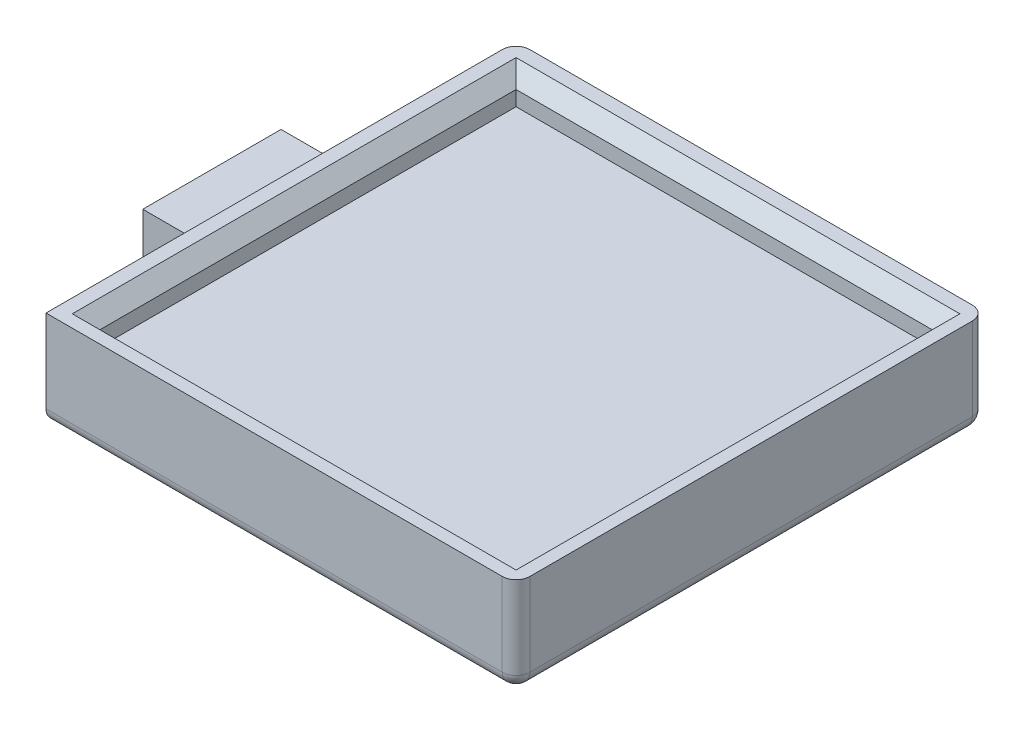
ISO-10303-21;
HEADER;
FILE_DESCRIPTION(('STEP AP214'),'2;1');
FILE_NAME('part.step','',(''),(''),'','','');
FILE_SCHEMA(('AUTOMOTIVE_DESIGN { 1 0 10303 214 1 1 1 1 }'));
ENDSEC;
DATA;
#1=APPLICATION_CONTEXT('core data for automotive mechanical design processes');
#2=APPLICATION_PROTOCOL_DEFINITION('international standard','automotive_design',2000,#1);
#3=PRODUCT_CONTEXT('',#1,'mechanical');
#4=PRODUCT('Part','Part','',(#3));
#5=PRODUCT_RELATED_PRODUCT_CATEGORY('part','',(#4));
#6=PRODUCT_DEFINITION_FORMATION('','',#4);
#7=PRODUCT_DEFINITION_CONTEXT('part definition',#1,'design');
#8=PRODUCT_DEFINITION('design','',#6,#7);
#9=PRODUCT_DEFINITION_SHAPE('','',#8);
#10=(LENGTH_UNIT() NAMED_UNIT(*) SI_UNIT(.MILLI.,.METRE.));
#11=(NAMED_UNIT(*) PLANE_ANGLE_UNIT() SI_UNIT($,.RADIAN.));
#12=(NAMED_UNIT(*) SI_UNIT($,.STERADIAN.) SOLID_ANGLE_UNIT());
#13=UNCERTAINTY_MEASURE_WITH_UNIT(LENGTH_MEASURE(1.E-05),#10,'distance_accuracy_value','');
#14=(GEOMETRIC_REPRESENTATION_CONTEXT(3) GLOBAL_UNCERTAINTY_ASSIGNED_CONTEXT((#13)) GLOBAL_UNIT_ASSIGNED_CONTEXT((#10,
#11,#12)) REPRESENTATION_CONTEXT('',''));
#15=CARTESIAN_POINT('',(0.,0.,0.));
#16=DIRECTION('',(0.,0.,1.));
#17=DIRECTION('',(1.,0.,0.));
#18=AXIS2_PLACEMENT_3D('',#15,#16,#17);
#19=CARTESIAN_POINT('',(0.,5.,0.));
#20=DIRECTION('',(0.,-1.,0.));
#21=DIRECTION('',(0.,0.,-1.));
#22=AXIS2_PLACEMENT_3D('',#19,#20,#21);
#23=PLANE('',#22);
#24=DIRECTION('',(0.,0.,1.));
#25=VECTOR('',#24,1.);
#26=CARTESIAN_POINT('',(5.,5.,0.));
#27=LINE('',#26,#25);
#28=CARTESIAN_POINT('',(5.,5.,-10.));
#29=VERTEX_POINT('',#28);
#30=CARTESIAN_POINT('',(5.,5.,0.));
#31=VERTEX_POINT('',#30);
#32=EDGE_CURVE('E248',#29,#31,#27,.T.);
#33=ORIENTED_EDGE('',*,*,#32,.F.);
#34=DIRECTION('',(1.,0.,0.));
#35=VECTOR('',#34,1.);
#36=CARTESIAN_POINT('',(0.,5.,-10.));
#37=LINE('',#36,#35);
#38=CARTESIAN_POINT('',(0.,5.,-10.));
#39=VERTEX_POINT('',#38);
#40=EDGE_CURVE('E259',#39,#29,#37,.T.);
#41=ORIENTED_EDGE('',*,*,#40,.F.);
#42=DIRECTION('',(0.,0.,-1.));
#43=VECTOR('',#42,1.);
#44=CARTESIAN_POINT('',(0.,5.,0.));
#45=LINE('',#44,#43);
#46=CARTESIAN_POINT('',(0.,5.,0.));
#47=VERTEX_POINT('',#46);
#48=EDGE_CURVE('E255',#47,#39,#45,.T.);
#49=ORIENTED_EDGE('',*,*,#48,.F.);
#50=DIRECTION('',(-1.,0.,0.));
#51=VECTOR('',#50,1.);
#52=CARTESIAN_POINT('',(5.,5.,0.));
#53=LINE('',#52,#51);
#54=EDGE_CURVE('E252',#31,#47,#53,.T.);
#55=ORIENTED_EDGE('',*,*,#54,.F.);
#56=EDGE_LOOP('',(#33,#41,#49,#55));
#57=FACE_BOUND('',#56,.T.);
#58=ADVANCED_FACE('F69',(#57),#23,.F.);
#59=CARTESIAN_POINT('',(5.,5.,0.));
#60=DIRECTION('',(0.,0.,1.));
#61=DIRECTION('',(1.,0.,0.));
#62=AXIS2_PLACEMENT_3D('',#59,#60,#61);
#63=PLANE('',#62);
#64=DIRECTION('',(-1.,0.,0.));
#65=VECTOR('',#64,1.);
#66=CARTESIAN_POINT('',(5.,0.,0.));
#67=LINE('',#66,#65);
#68=CARTESIAN_POINT('',(5.,0.,0.));
#69=VERTEX_POINT('',#68);
#70=CARTESIAN_POINT('',(0.,0.,0.));
#71=VERTEX_POINT('',#70);
#72=EDGE_CURVE('E247',#69,#71,#67,.T.);
#73=ORIENTED_EDGE('',*,*,#72,.F.);
#74=DIRECTION('',(0.,-1.,0.));
#75=VECTOR('',#74,1.);
#76=CARTESIAN_POINT('',(5.,5.,0.));
#77=LINE('',#76,#75);
#78=EDGE_CURVE('E251',#31,#69,#77,.T.);
#79=ORIENTED_EDGE('',*,*,#78,.F.);
#80=ORIENTED_EDGE('',*,*,#54,.T.);
#81=DIRECTION('',(0.,-1.,0.));
#82=VECTOR('',#81,1.);
#83=CARTESIAN_POINT('',(0.,5.,0.));
#84=LINE('',#83,#82);
#85=EDGE_CURVE('E262',#47,#71,#84,.T.);
#86=ORIENTED_EDGE('',*,*,#85,.T.);
#87=EDGE_LOOP('',(#73,#79,#80,#86));
#88=FACE_BOUND('',#87,.T.);
#89=ADVANCED_FACE('F412',(#88),#63,.T.);
#90=CARTESIAN_POINT('',(5.,5.,12.));
#91=DIRECTION('',(-1.,0.,0.));
#92=DIRECTION('',(0.,0.,1.));
#93=AXIS2_PLACEMENT_3D('',#90,#91,#92);
#94=PLANE('',#93);
#95=DIRECTION('',(0.,0.,-1.));
#96=VECTOR('',#95,1.);
#97=CARTESIAN_POINT('',(5.,0.,12.));
#98=LINE('',#97,#96);
#99=CARTESIAN_POINT('',(5.,0.,11.));
#100=VERTEX_POINT('',#99);
#101=EDGE_CURVE('E256',#100,#69,#98,.T.);
#102=ORIENTED_EDGE('',*,*,#101,.F.);
#103=CARTESIAN_POINT('',(5.,1.,11.));
#104=DIRECTION('',(-1.,0.,0.));
#105=DIRECTION('',(0.,0.,1.));
#106=AXIS2_PLACEMENT_3D('',#103,#104,#105);
#107=CIRCLE('',#106,1.);
#108=CARTESIAN_POINT('',(5.,1.,12.));
#109=VERTEX_POINT('',#108);
#110=EDGE_CURVE('E316',#100,#109,#107,.T.);
#111=ORIENTED_EDGE('',*,*,#110,.T.);
#112=DIRECTION('',(0.,-1.,0.));
#113=VECTOR('',#112,1.);
#114=CARTESIAN_POINT('',(5.,5.,12.));
#115=LINE('',#114,#113);
#116=CARTESIAN_POINT('',(5.,7.,12.));
#117=VERTEX_POINT('',#116);
#118=EDGE_CURVE('E277',#117,#109,#115,.T.);
#119=ORIENTED_EDGE('',*,*,#118,.F.);
#120=DIRECTION('',(0.,0.,1.));
#121=VECTOR('',#120,1.);
#122=CARTESIAN_POINT('',(5.,7.,0.));
#123=LINE('',#122,#121);
#124=CARTESIAN_POINT('',(4.99999999999999,7.,-21.));
#125=VERTEX_POINT('',#124);
#126=EDGE_CURVE('E232',#125,#117,#123,.T.);
#127=ORIENTED_EDGE('',*,*,#126,.F.);
#128=DIRECTION('',(0.,-1.,0.));
#129=VECTOR('',#128,1.);
#130=CARTESIAN_POINT('',(5.,5.,-21.));
#131=LINE('',#130,#129);
#132=CARTESIAN_POINT('',(4.99999999999999,0.,-21.));
#133=VERTEX_POINT('',#132);
#134=EDGE_CURVE('E314',#125,#133,#131,.T.);
#135=ORIENTED_EDGE('',*,*,#134,.T.);
#136=DIRECTION('',(0.,0.,-1.));
#137=VECTOR('',#136,1.);
#138=CARTESIAN_POINT('',(4.99999999999999,0.,-10.));
#139=LINE('',#138,#137);
#140=CARTESIAN_POINT('',(4.99999999999999,0.,-10.));
#141=VERTEX_POINT('',#140);
#142=EDGE_CURVE('E271',#141,#133,#139,.T.);
#143=ORIENTED_EDGE('',*,*,#142,.F.);
#144=DIRECTION('',(0.,-1.,0.));
#145=VECTOR('',#144,1.);
#146=CARTESIAN_POINT('',(4.99999999999999,5.,-10.));
#147=LINE('',#146,#145);
#148=EDGE_CURVE('E280',#29,#141,#147,.T.);
#149=ORIENTED_EDGE('',*,*,#148,.F.);
#150=ORIENTED_EDGE('',*,*,#32,.T.);
#151=ORIENTED_EDGE('',*,*,#78,.T.);
#152=EDGE_LOOP('',(#102,#111,#119,#127,#135,#143,#149,#150,#151));
#153=FACE_BOUND('',#152,.T.);
#154=ADVANCED_FACE('F389',(#153),#94,.T.);
#155=CARTESIAN_POINT('',(39.,5.,12.));
#156=DIRECTION('',(0.,0.,1.));
#157=DIRECTION('',(1.,0.,0.));
#158=AXIS2_PLACEMENT_3D('',#155,#156,#157);
#159=PLANE('',#158);
#160=ORIENTED_EDGE('',*,*,#118,.T.);
#161=DIRECTION('',(-1.,0.,0.));
#162=VECTOR('',#161,1.);
#163=CARTESIAN_POINT('',(39.,1.,12.));
#164=LINE('',#163,#162);
#165=CARTESIAN_POINT('',(38.,1.,12.));
#166=VERTEX_POINT('',#165);
#167=EDGE_CURVE('E320',#109,#166,#164,.F.);
#168=ORIENTED_EDGE('',*,*,#167,.T.);
#169=DIRECTION('',(0.,-1.,0.));
#170=VECTOR('',#169,1.);
#171=CARTESIAN_POINT('',(38.,5.,12.));
#172=LINE('',#171,#170);
#173=CARTESIAN_POINT('',(38.,7.,12.));
#174=VERTEX_POINT('',#173);
#175=EDGE_CURVE('E318',#166,#174,#172,.F.);
#176=ORIENTED_EDGE('',*,*,#175,.T.);
#177=DIRECTION('',(1.,0.,0.));
#178=VECTOR('',#177,1.);
#179=CARTESIAN_POINT('',(0.,7.,12.));
#180=LINE('',#179,#178);
#181=EDGE_CURVE('E238',#117,#174,#180,.T.);
#182=ORIENTED_EDGE('',*,*,#181,.F.);
#183=EDGE_LOOP('',(#160,#168,#176,#182));
#184=FACE_BOUND('',#183,.T.);
#185=ADVANCED_FACE('F403',(#184),#159,.T.);
#186=CARTESIAN_POINT('',(39.,5.,-22.));
#187=DIRECTION('',(1.,0.,0.));
#188=DIRECTION('',(0.,0.,-1.));
#189=AXIS2_PLACEMENT_3D('',#186,#187,#188);
#190=PLANE('',#189);
#191=DIRECTION('',(0.,0.,-1.));
#192=VECTOR('',#191,1.);
#193=CARTESIAN_POINT('',(39.,7.,0.));
#194=LINE('',#193,#192);
#195=CARTESIAN_POINT('',(39.,7.,11.));
#196=VERTEX_POINT('',#195);
#197=CARTESIAN_POINT('',(39.,7.,-21.));
#198=VERTEX_POINT('',#197);
#199=EDGE_CURVE('E241',#196,#198,#194,.T.);
#200=ORIENTED_EDGE('',*,*,#199,.F.);
#201=DIRECTION('',(0.,-1.,0.));
#202=VECTOR('',#201,1.);
#203=CARTESIAN_POINT('',(39.,5.,11.));
#204=LINE('',#203,#202);
#205=CARTESIAN_POINT('',(39.,1.,11.));
#206=VERTEX_POINT('',#205);
#207=EDGE_CURVE('E86',#196,#206,#204,.T.);
#208=ORIENTED_EDGE('',*,*,#207,.T.);
#209=DIRECTION('',(0.,0.,1.));
#210=VECTOR('',#209,1.);
#211=CARTESIAN_POINT('',(39.,1.,-22.));
#212=LINE('',#211,#210);
#213=CARTESIAN_POINT('',(39.,1.,-21.));
#214=VERTEX_POINT('',#213);
#215=EDGE_CURVE('E90',#206,#214,#212,.F.);
#216=ORIENTED_EDGE('',*,*,#215,.T.);
#217=DIRECTION('',(0.,-1.,0.));
#218=VECTOR('',#217,1.);
#219=CARTESIAN_POINT('',(39.,5.,-21.));
#220=LINE('',#219,#218);
#221=EDGE_CURVE('E328',#214,#198,#220,.F.);
#222=ORIENTED_EDGE('',*,*,#221,.T.);
#223=EDGE_LOOP('',(#200,#208,#216,#222));
#224=FACE_BOUND('',#223,.T.);
#225=ADVANCED_FACE('F405',(#224),#190,.T.);
#226=CARTESIAN_POINT('',(4.99999999999999,5.,-22.));
#227=DIRECTION('',(0.,0.,-1.));
#228=DIRECTION('',(-1.,0.,0.));
#229=AXIS2_PLACEMENT_3D('',#226,#227,#228);
#230=PLANE('',#229);
#231=DIRECTION('',(1.,0.,0.));
#232=VECTOR('',#231,1.);
#233=CARTESIAN_POINT('',(4.99999999999999,1.,-22.));
#234=LINE('',#233,#232);
#235=CARTESIAN_POINT('',(38.,1.,-22.));
#236=VERTEX_POINT('',#235);
#237=CARTESIAN_POINT('',(6.,1.,-22.));
#238=VERTEX_POINT('',#237);
#239=EDGE_CURVE('E324',#236,#238,#234,.F.);
#240=ORIENTED_EDGE('',*,*,#239,.T.);
#241=DIRECTION('',(0.,-1.,0.));
#242=VECTOR('',#241,1.);
#243=CARTESIAN_POINT('',(6.,5.,-22.));
#244=LINE('',#243,#242);
#245=CARTESIAN_POINT('',(6.,7.,-22.));
#246=VERTEX_POINT('',#245);
#247=EDGE_CURVE('E326',#238,#246,#244,.F.);
#248=ORIENTED_EDGE('',*,*,#247,.T.);
#249=DIRECTION('',(1.,0.,0.));
#250=VECTOR('',#249,1.);
#251=CARTESIAN_POINT('',(0.,7.,-22.));
#252=LINE('',#251,#250);
#253=CARTESIAN_POINT('',(38.,7.,-22.));
#254=VERTEX_POINT('',#253);
#255=EDGE_CURVE('E244',#246,#254,#252,.T.);
#256=ORIENTED_EDGE('',*,*,#255,.T.);
#257=DIRECTION('',(0.,-1.,0.));
#258=VECTOR('',#257,1.);
#259=CARTESIAN_POINT('',(38.,5.,-22.));
#260=LINE('',#259,#258);
#261=EDGE_CURVE('E322',#254,#236,#260,.T.);
#262=ORIENTED_EDGE('',*,*,#261,.T.);
#263=EDGE_LOOP('',(#240,#248,#256,#262));
#264=FACE_BOUND('',#263,.T.);
#265=ADVANCED_FACE('F367',(#264),#230,.T.);
#266=CARTESIAN_POINT('',(0.,5.,-10.));
#267=DIRECTION('',(0.,0.,-1.));
#268=DIRECTION('',(-1.,0.,0.));
#269=AXIS2_PLACEMENT_3D('',#266,#267,#268);
#270=PLANE('',#269);
#271=DIRECTION('',(1.,0.,0.));
#272=VECTOR('',#271,1.);
#273=CARTESIAN_POINT('',(0.,0.,-10.));
#274=LINE('',#273,#272);
#275=CARTESIAN_POINT('',(0.,0.,-10.));
#276=VERTEX_POINT('',#275);
#277=EDGE_CURVE('E268',#276,#141,#274,.T.);
#278=ORIENTED_EDGE('',*,*,#277,.F.);
#279=DIRECTION('',(0.,-1.,0.));
#280=VECTOR('',#279,1.);
#281=CARTESIAN_POINT('',(0.,5.,-10.));
#282=LINE('',#281,#280);
#283=EDGE_CURVE('E282',#39,#276,#282,.T.);
#284=ORIENTED_EDGE('',*,*,#283,.F.);
#285=ORIENTED_EDGE('',*,*,#40,.T.);
#286=ORIENTED_EDGE('',*,*,#148,.T.);
#287=EDGE_LOOP('',(#278,#284,#285,#286));
#288=FACE_BOUND('',#287,.T.);
#289=ADVANCED_FACE('F433',(#288),#270,.T.);
#290=CARTESIAN_POINT('',(0.,5.,0.));
#291=DIRECTION('',(-1.,0.,0.));
#292=DIRECTION('',(0.,0.,1.));
#293=AXIS2_PLACEMENT_3D('',#290,#291,#292);
#294=PLANE('',#293);
#295=DIRECTION('',(0.,0.,-1.));
#296=VECTOR('',#295,1.);
#297=CARTESIAN_POINT('',(0.,0.,0.));
#298=LINE('',#297,#296);
#299=EDGE_CURVE('E265',#71,#276,#298,.T.);
#300=ORIENTED_EDGE('',*,*,#299,.F.);
#301=ORIENTED_EDGE('',*,*,#85,.F.);
#302=ORIENTED_EDGE('',*,*,#48,.T.);
#303=ORIENTED_EDGE('',*,*,#283,.T.);
#304=EDGE_LOOP('',(#300,#301,#302,#303));
#305=FACE_BOUND('',#304,.T.);
#306=ADVANCED_FACE('F427',(#305),#294,.T.);
#307=CARTESIAN_POINT('',(0.,0.,0.));
#308=DIRECTION('',(0.,-1.,0.));
#309=DIRECTION('',(0.,0.,-1.));
#310=AXIS2_PLACEMENT_3D('',#307,#308,#309);
#311=PLANE('',#310);
#312=DIRECTION('',(0.,0.,1.));
#313=VECTOR('',#312,1.);
#314=CARTESIAN_POINT('',(38.,0.,0.));
#315=LINE('',#314,#313);
#316=CARTESIAN_POINT('',(38.,0.,-21.));
#317=VERTEX_POINT('',#316);
#318=CARTESIAN_POINT('',(38.,0.,11.));
#319=VERTEX_POINT('',#318);
#320=EDGE_CURVE('E301',#317,#319,#315,.T.);
#321=ORIENTED_EDGE('',*,*,#320,.T.);
#322=DIRECTION('',(-1.,0.,0.));
#323=VECTOR('',#322,1.);
#324=CARTESIAN_POINT('',(0.,0.,11.));
#325=LINE('',#324,#323);
#326=EDGE_CURVE('E311',#319,#100,#325,.T.);
#327=ORIENTED_EDGE('',*,*,#326,.T.);
#328=ORIENTED_EDGE('',*,*,#101,.T.);
#329=ORIENTED_EDGE('',*,*,#72,.T.);
#330=ORIENTED_EDGE('',*,*,#299,.T.);
#331=ORIENTED_EDGE('',*,*,#277,.T.);
#332=ORIENTED_EDGE('',*,*,#142,.T.);
#333=DIRECTION('',(1.,0.,0.));
#334=VECTOR('',#333,1.);
#335=CARTESIAN_POINT('',(0.,0.,-21.));
#336=LINE('',#335,#334);
#337=EDGE_CURVE('E309',#133,#317,#336,.T.);
#338=ORIENTED_EDGE('',*,*,#337,.T.);
#339=EDGE_LOOP('',(#321,#327,#328,#329,#330,#331,#332,#338));
#340=FACE_BOUND('',#339,.T.);
#341=ADVANCED_FACE('F382',(#340),#311,.T.);
#342=CARTESIAN_POINT('',(0.,7.,0.));
#343=DIRECTION('',(0.,1.,0.));
#344=DIRECTION('',(0.,0.,1.));
#345=AXIS2_PLACEMENT_3D('',#342,#343,#344);
#346=PLANE('',#345);
#347=DIRECTION('',(0.,0.,-1.));
#348=VECTOR('',#347,1.);
#349=CARTESIAN_POINT('',(6.00000000000001,7.,-20.));
#350=LINE('',#349,#348);
#351=CARTESIAN_POINT('',(6.00000000000001,7.,11.1));
#352=VERTEX_POINT('',#351);
#353=CARTESIAN_POINT('',(6.00000000000001,7.,-21.));
#354=VERTEX_POINT('',#353);
#355=EDGE_CURVE('E250',#352,#354,#350,.T.);
#356=ORIENTED_EDGE('',*,*,#355,.T.);
#357=DIRECTION('',(1.,0.,0.));
#358=VECTOR('',#357,1.);
#359=CARTESIAN_POINT('',(0.,7.,-21.));
#360=LINE('',#359,#358);
#361=CARTESIAN_POINT('',(38.1,7.,-21.));
#362=VERTEX_POINT('',#361);
#363=EDGE_CURVE('E290',#354,#362,#360,.T.);
#364=ORIENTED_EDGE('',*,*,#363,.T.);
#365=DIRECTION('',(0.,0.,1.));
#366=VECTOR('',#365,1.);
#367=CARTESIAN_POINT('',(38.1,7.,0.));
#368=LINE('',#367,#366);
#369=CARTESIAN_POINT('',(38.1,7.,11.1));
#370=VERTEX_POINT('',#369);
#371=EDGE_CURVE('E288',#362,#370,#368,.T.);
#372=ORIENTED_EDGE('',*,*,#371,.T.);
#373=DIRECTION('',(-1.,0.,0.));
#374=VECTOR('',#373,1.);
#375=CARTESIAN_POINT('',(7.,7.,11.1));
#376=LINE('',#375,#374);
#377=EDGE_CURVE('E286',#370,#352,#376,.T.);
#378=ORIENTED_EDGE('',*,*,#377,.T.);
#379=EDGE_LOOP('',(#356,#364,#372,#378));
#380=FACE_BOUND('',#379,.T.);
#381=ORIENTED_EDGE('',*,*,#181,.T.);
#382=CARTESIAN_POINT('',(38.,7.,11.));
#383=DIRECTION('',(0.,1.,0.));
#384=DIRECTION('',(0.,0.,1.));
#385=AXIS2_PLACEMENT_3D('',#382,#383,#384);
#386=CIRCLE('',#385,1.);
#387=EDGE_CURVE('E12',#174,#196,#386,.T.);
#388=ORIENTED_EDGE('',*,*,#387,.T.);
#389=ORIENTED_EDGE('',*,*,#199,.T.);
#390=CARTESIAN_POINT('',(38.,7.,-21.));
#391=DIRECTION('',(0.,1.,0.));
#392=DIRECTION('',(0.,0.,1.));
#393=AXIS2_PLACEMENT_3D('',#390,#391,#392);
#394=CIRCLE('',#393,1.);
#395=EDGE_CURVE('E332',#198,#254,#394,.T.);
#396=ORIENTED_EDGE('',*,*,#395,.T.);
#397=ORIENTED_EDGE('',*,*,#255,.F.);
#398=CARTESIAN_POINT('',(6.,7.,-21.));
#399=DIRECTION('',(0.,1.,0.));
#400=DIRECTION('',(0.,0.,1.));
#401=AXIS2_PLACEMENT_3D('',#398,#399,#400);
#402=CIRCLE('',#401,1.);
#403=EDGE_CURVE('E78',#246,#125,#402,.T.);
#404=ORIENTED_EDGE('',*,*,#403,.T.);
#405=ORIENTED_EDGE('',*,*,#126,.T.);
#406=EDGE_LOOP('',(#381,#388,#389,#396,#397,#404,#405));
#407=FACE_BOUND('',#406,.T.);
#408=ADVANCED_FACE('F370',(#380,#407),#346,.T.);
#409=CARTESIAN_POINT('',(7.,4.92,10.1));
#410=DIRECTION('',(0.,0.,1.));
#411=DIRECTION('',(1.,0.,0.));
#412=AXIS2_PLACEMENT_3D('',#409,#410,#411);
#413=PLANE('',#412);
#414=DIRECTION('',(0.,1.,0.));
#415=VECTOR('',#414,1.);
#416=CARTESIAN_POINT('',(7.,4.92,10.1));
#417=LINE('',#416,#415);
#418=CARTESIAN_POINT('',(7.,4.92,10.1));
#419=VERTEX_POINT('',#418);
#420=CARTESIAN_POINT('',(7.,6.00000000000001,10.1));
#421=VERTEX_POINT('',#420);
#422=EDGE_CURVE('E230',#419,#421,#417,.T.);
#423=ORIENTED_EDGE('',*,*,#422,.T.);
#424=DIRECTION('',(1.,0.,0.));
#425=VECTOR('',#424,1.);
#426=CARTESIAN_POINT('',(37.1,6.00000000000001,10.1));
#427=LINE('',#426,#425);
#428=CARTESIAN_POINT('',(37.1,6.00000000000001,10.1));
#429=VERTEX_POINT('',#428);
#430=EDGE_CURVE('E217',#421,#429,#427,.T.);
#431=ORIENTED_EDGE('',*,*,#430,.T.);
#432=DIRECTION('',(0.,1.,0.));
#433=VECTOR('',#432,1.);
#434=CARTESIAN_POINT('',(37.1,4.92,10.1));
#435=LINE('',#434,#433);
#436=CARTESIAN_POINT('',(37.1,4.92,10.1));
#437=VERTEX_POINT('',#436);
#438=EDGE_CURVE('E201',#437,#429,#435,.T.);
#439=ORIENTED_EDGE('',*,*,#438,.F.);
#440=DIRECTION('',(1.,0.,0.));
#441=VECTOR('',#440,1.);
#442=CARTESIAN_POINT('',(7.,4.92,10.1));
#443=LINE('',#442,#441);
#444=EDGE_CURVE('E209',#419,#437,#443,.T.);
#445=ORIENTED_EDGE('',*,*,#444,.F.);
#446=EDGE_LOOP('',(#423,#431,#439,#445));
#447=FACE_BOUND('',#446,.T.);
#448=ADVANCED_FACE('F214',(#447),#413,.F.);
#449=CARTESIAN_POINT('',(6.99999999999999,4.92,-20.));
#450=DIRECTION('',(-1.,0.,0.));
#451=DIRECTION('',(0.,0.,1.));
#452=AXIS2_PLACEMENT_3D('',#449,#450,#451);
#453=PLANE('',#452);
#454=DIRECTION('',(0.,1.,0.));
#455=VECTOR('',#454,1.);
#456=CARTESIAN_POINT('',(6.99999999999999,4.92,-20.));
#457=LINE('',#456,#455);
#458=CARTESIAN_POINT('',(6.99999999999999,4.92,-20.));
#459=VERTEX_POINT('',#458);
#460=CARTESIAN_POINT('',(6.99999999999999,6.00000000000001,-20.));
#461=VERTEX_POINT('',#460);
#462=EDGE_CURVE('E233',#459,#461,#457,.T.);
#463=ORIENTED_EDGE('',*,*,#462,.T.);
#464=DIRECTION('',(0.,0.,1.));
#465=VECTOR('',#464,1.);
#466=CARTESIAN_POINT('',(7.,6.00000000000001,10.1));
#467=LINE('',#466,#465);
#468=EDGE_CURVE('E299',#461,#421,#467,.T.);
#469=ORIENTED_EDGE('',*,*,#468,.T.);
#470=ORIENTED_EDGE('',*,*,#422,.F.);
#471=DIRECTION('',(0.,0.,1.));
#472=VECTOR('',#471,1.);
#473=CARTESIAN_POINT('',(6.99999999999999,4.92,-20.));
#474=LINE('',#473,#472);
#475=EDGE_CURVE('E218',#459,#419,#474,.T.);
#476=ORIENTED_EDGE('',*,*,#475,.F.);
#477=EDGE_LOOP('',(#463,#469,#470,#476));
#478=FACE_BOUND('',#477,.T.);
#479=ADVANCED_FACE('F508',(#478),#453,.F.);
#480=CARTESIAN_POINT('',(6.99999999999999,4.92,-20.));
#481=DIRECTION('',(0.,0.,1.));
#482=DIRECTION('',(1.,0.,0.));
#483=AXIS2_PLACEMENT_3D('',#480,#481,#482);
#484=PLANE('',#483);
#485=DIRECTION('',(0.,1.,0.));
#486=VECTOR('',#485,1.);
#487=CARTESIAN_POINT('',(37.1,4.92,-20.));
#488=LINE('',#487,#486);
#489=CARTESIAN_POINT('',(37.1,4.92,-20.));
#490=VERTEX_POINT('',#489);
#491=CARTESIAN_POINT('',(37.1,6.00000000000001,-20.));
#492=VERTEX_POINT('',#491);
#493=EDGE_CURVE('E204',#490,#492,#488,.T.);
#494=ORIENTED_EDGE('',*,*,#493,.T.);
#495=DIRECTION('',(-1.,0.,0.));
#496=VECTOR('',#495,1.);
#497=CARTESIAN_POINT('',(6.99999999999999,6.00000000000001,-20.));
#498=LINE('',#497,#496);
#499=EDGE_CURVE('E293',#492,#461,#498,.T.);
#500=ORIENTED_EDGE('',*,*,#499,.T.);
#501=ORIENTED_EDGE('',*,*,#462,.F.);
#502=DIRECTION('',(1.,0.,0.));
#503=VECTOR('',#502,1.);
#504=CARTESIAN_POINT('',(6.99999999999999,4.92,-20.));
#505=LINE('',#504,#503);
#506=EDGE_CURVE('E208',#459,#490,#505,.T.);
#507=ORIENTED_EDGE('',*,*,#506,.T.);
#508=EDGE_LOOP('',(#494,#500,#501,#507));
#509=FACE_BOUND('',#508,.T.);
#510=ADVANCED_FACE('F517',(#509),#484,.T.);
#511=CARTESIAN_POINT('',(37.1,4.92,-20.));
#512=DIRECTION('',(-1.,0.,0.));
#513=DIRECTION('',(0.,0.,1.));
#514=AXIS2_PLACEMENT_3D('',#511,#512,#513);
#515=PLANE('',#514);
#516=ORIENTED_EDGE('',*,*,#438,.T.);
#517=DIRECTION('',(0.,0.,-1.));
#518=VECTOR('',#517,1.);
#519=CARTESIAN_POINT('',(37.1,6.00000000000001,-20.));
#520=LINE('',#519,#518);
#521=EDGE_CURVE('E296',#429,#492,#520,.T.);
#522=ORIENTED_EDGE('',*,*,#521,.T.);
#523=ORIENTED_EDGE('',*,*,#493,.F.);
#524=DIRECTION('',(0.,0.,1.));
#525=VECTOR('',#524,1.);
#526=CARTESIAN_POINT('',(37.1,4.92,-20.));
#527=LINE('',#526,#525);
#528=EDGE_CURVE('E198',#490,#437,#527,.T.);
#529=ORIENTED_EDGE('',*,*,#528,.T.);
#530=EDGE_LOOP('',(#516,#522,#523,#529));
#531=FACE_BOUND('',#530,.T.);
#532=ADVANCED_FACE('F200',(#531),#515,.T.);
#533=CARTESIAN_POINT('',(0.,4.92,0.));
#534=DIRECTION('',(0.,-1.,0.));
#535=DIRECTION('',(0.,0.,-1.));
#536=AXIS2_PLACEMENT_3D('',#533,#534,#535);
#537=PLANE('',#536);
#538=ORIENTED_EDGE('',*,*,#444,.T.);
#539=ORIENTED_EDGE('',*,*,#528,.F.);
#540=ORIENTED_EDGE('',*,*,#506,.F.);
#541=ORIENTED_EDGE('',*,*,#475,.T.);
#542=EDGE_LOOP('',(#538,#539,#540,#541));
#543=FACE_BOUND('',#542,.T.);
#544=ADVANCED_FACE('F220',(#543),#537,.F.);
#545=CARTESIAN_POINT('',(7.,6.00000000000001,10.1));
#546=DIRECTION('',(0.,0.707106781186547,-0.707106781186547));
#547=DIRECTION('',(-1.,0.,0.));
#548=AXIS2_PLACEMENT_3D('',#545,#546,#547);
#549=PLANE('',#548);
#550=DIRECTION('',(0.577350269189627,0.577350269189625,0.577350269189625));
#551=VECTOR('',#550,1.);
#552=CARTESIAN_POINT('',(34.4,3.3,7.4));
#553=LINE('',#552,#551);
#554=EDGE_CURVE('E225',#429,#370,#553,.T.);
#555=ORIENTED_EDGE('',*,*,#554,.F.);
#556=ORIENTED_EDGE('',*,*,#430,.F.);
#557=DIRECTION('',(0.577350269189626,-0.577350269189626,-0.577350269189626));
#558=VECTOR('',#557,1.);
#559=CARTESIAN_POINT('',(7.,6.00000000000001,10.1));
#560=LINE('',#559,#558);
#561=EDGE_CURVE('E222',#352,#421,#560,.T.);
#562=ORIENTED_EDGE('',*,*,#561,.F.);
#563=ORIENTED_EDGE('',*,*,#377,.F.);
#564=EDGE_LOOP('',(#555,#556,#562,#563));
#565=FACE_BOUND('',#564,.T.);
#566=ADVANCED_FACE('F465',(#565),#549,.T.);
#567=CARTESIAN_POINT('',(6.99999999999999,6.00000000000001,-20.));
#568=DIRECTION('',(0.707106781186548,0.707106781186547,0.));
#569=DIRECTION('',(0.,0.,-1.));
#570=AXIS2_PLACEMENT_3D('',#567,#568,#569);
#571=PLANE('',#570);
#572=ORIENTED_EDGE('',*,*,#561,.T.);
#573=ORIENTED_EDGE('',*,*,#468,.F.);
#574=DIRECTION('',(0.577350269189626,-0.577350269189626,0.577350269189626));
#575=VECTOR('',#574,1.);
#576=CARTESIAN_POINT('',(4.00000000000001,9.,-23.));
#577=LINE('',#576,#575);
#578=EDGE_CURVE('E304',#354,#461,#577,.T.);
#579=ORIENTED_EDGE('',*,*,#578,.F.);
#580=ORIENTED_EDGE('',*,*,#355,.F.);
#581=EDGE_LOOP('',(#572,#573,#579,#580));
#582=FACE_BOUND('',#581,.T.);
#583=ADVANCED_FACE('F458',(#582),#571,.T.);
#584=CARTESIAN_POINT('',(38.1,7.,0.));
#585=DIRECTION('',(0.707106781186547,-0.707106781186548,0.));
#586=DIRECTION('',(0.,0.,1.));
#587=AXIS2_PLACEMENT_3D('',#584,#585,#586);
#588=PLANE('',#587);
#589=ORIENTED_EDGE('',*,*,#554,.T.);
#590=ORIENTED_EDGE('',*,*,#371,.F.);
#591=DIRECTION('',(-0.577350269189627,-0.577350269189625,0.577350269189625));
#592=VECTOR('',#591,1.);
#593=CARTESIAN_POINT('',(25.3999999999999,-5.7,-8.29999999999998));
#594=LINE('',#593,#592);
#595=EDGE_CURVE('E302',#492,#362,#594,.F.);
#596=ORIENTED_EDGE('',*,*,#595,.F.);
#597=ORIENTED_EDGE('',*,*,#521,.F.);
#598=EDGE_LOOP('',(#589,#590,#596,#597));
#599=FACE_BOUND('',#598,.T.);
#600=ADVANCED_FACE('F451',(#599),#588,.F.);
#601=CARTESIAN_POINT('',(0.,7.,-21.));
#602=DIRECTION('',(0.,-0.707106781186547,-0.707106781186547));
#603=DIRECTION('',(1.,0.,0.));
#604=AXIS2_PLACEMENT_3D('',#601,#602,#603);
#605=PLANE('',#604);
#606=ORIENTED_EDGE('',*,*,#578,.T.);
#607=ORIENTED_EDGE('',*,*,#499,.F.);
#608=ORIENTED_EDGE('',*,*,#595,.T.);
#609=ORIENTED_EDGE('',*,*,#363,.F.);
#610=EDGE_LOOP('',(#606,#607,#608,#609));
#611=FACE_BOUND('',#610,.T.);
#612=ADVANCED_FACE('F445',(#611),#605,.F.);
#613=CARTESIAN_POINT('',(6.,5.,-21.));
#614=DIRECTION('',(0.,-1.,0.));
#615=DIRECTION('',(0.,0.,-1.));
#616=AXIS2_PLACEMENT_3D('',#613,#614,#615);
#617=CYLINDRICAL_SURFACE('',#616,1.);
#618=ORIENTED_EDGE('',*,*,#403,.F.);
#619=ORIENTED_EDGE('',*,*,#247,.F.);
#620=CARTESIAN_POINT('',(6.,1.,-21.));
#621=DIRECTION('',(0.707106781186547,-0.707106781186547,0.));
#622=DIRECTION('',(-0.707106781186547,-0.707106781186547,0.));
#623=AXIS2_PLACEMENT_3D('',#620,#621,#622);
#624=ELLIPSE('',#623,1.41421356237309,1.);
#625=EDGE_CURVE('E73',#133,#238,#624,.T.);
#626=ORIENTED_EDGE('',*,*,#625,.F.);
#627=ORIENTED_EDGE('',*,*,#134,.F.);
#628=EDGE_LOOP('',(#618,#619,#626,#627));
#629=FACE_BOUND('',#628,.T.);
#630=ADVANCED_FACE('F71',(#629),#617,.T.);
#631=CARTESIAN_POINT('',(38.,5.,-21.));
#632=DIRECTION('',(0.,-1.,0.));
#633=DIRECTION('',(0.,0.,-1.));
#634=AXIS2_PLACEMENT_3D('',#631,#632,#633);
#635=CYLINDRICAL_SURFACE('',#634,1.);
#636=ORIENTED_EDGE('',*,*,#395,.F.);
#637=ORIENTED_EDGE('',*,*,#221,.F.);
#638=CARTESIAN_POINT('',(38.,1.,-21.));
#639=DIRECTION('',(0.,-1.,0.));
#640=DIRECTION('',(0.,0.,-1.));
#641=AXIS2_PLACEMENT_3D('',#638,#639,#640);
#642=CIRCLE('',#641,1.);
#643=EDGE_CURVE('E349',#236,#214,#642,.T.);
#644=ORIENTED_EDGE('',*,*,#643,.F.);
#645=ORIENTED_EDGE('',*,*,#261,.F.);
#646=EDGE_LOOP('',(#636,#637,#644,#645));
#647=FACE_BOUND('',#646,.T.);
#648=ADVANCED_FACE('F374',(#647),#635,.T.);
#649=CARTESIAN_POINT('',(0.,1.,-21.));
#650=DIRECTION('',(1.,0.,0.));
#651=DIRECTION('',(0.,0.,-1.));
#652=AXIS2_PLACEMENT_3D('',#649,#650,#651);
#653=CYLINDRICAL_SURFACE('',#652,1.);
#654=ORIENTED_EDGE('',*,*,#625,.T.);
#655=ORIENTED_EDGE('',*,*,#239,.F.);
#656=CARTESIAN_POINT('',(38.,1.,-21.));
#657=DIRECTION('',(1.,0.,0.));
#658=DIRECTION('',(0.,0.,-1.));
#659=AXIS2_PLACEMENT_3D('',#656,#657,#658);
#660=CIRCLE('',#659,1.);
#661=EDGE_CURVE('E347',#317,#236,#660,.T.);
#662=ORIENTED_EDGE('',*,*,#661,.F.);
#663=ORIENTED_EDGE('',*,*,#337,.F.);
#664=EDGE_LOOP('',(#654,#655,#662,#663));
#665=FACE_BOUND('',#664,.T.);
#666=ADVANCED_FACE('F359',(#665),#653,.T.);
#667=CARTESIAN_POINT('',(38.,1.,-21.));
#668=DIRECTION('',(0.,0.,-1.));
#669=DIRECTION('',(-1.,0.,0.));
#670=AXIS2_PLACEMENT_3D('',#667,#668,#669);
#671=SPHERICAL_SURFACE('',#670,1.);
#672=ORIENTED_EDGE('',*,*,#661,.T.);
#673=ORIENTED_EDGE('',*,*,#643,.T.);
#674=CARTESIAN_POINT('',(38.,1.,-21.));
#675=DIRECTION('',(0.,0.,-1.));
#676=DIRECTION('',(-1.,0.,0.));
#677=AXIS2_PLACEMENT_3D('',#674,#675,#676);
#678=CIRCLE('',#677,1.);
#679=EDGE_CURVE('E344',#317,#214,#678,.F.);
#680=ORIENTED_EDGE('',*,*,#679,.F.);
#681=EDGE_LOOP('',(#672,#673,#680));
#682=FACE_BOUND('',#681,.T.);
#683=ADVANCED_FACE('F375',(#682),#671,.T.);
#684=CARTESIAN_POINT('',(38.,5.,11.));
#685=DIRECTION('',(0.,-1.,0.));
#686=DIRECTION('',(0.,0.,-1.));
#687=AXIS2_PLACEMENT_3D('',#684,#685,#686);
#688=CYLINDRICAL_SURFACE('',#687,1.);
#689=ORIENTED_EDGE('',*,*,#387,.F.);
#690=ORIENTED_EDGE('',*,*,#175,.F.);
#691=CARTESIAN_POINT('',(38.,1.,11.));
#692=DIRECTION('',(0.,-1.,0.));
#693=DIRECTION('',(0.,0.,-1.));
#694=AXIS2_PLACEMENT_3D('',#691,#692,#693);
#695=CIRCLE('',#694,1.);
#696=EDGE_CURVE('E341',#206,#166,#695,.T.);
#697=ORIENTED_EDGE('',*,*,#696,.F.);
#698=ORIENTED_EDGE('',*,*,#207,.F.);
#699=EDGE_LOOP('',(#689,#690,#697,#698));
#700=FACE_BOUND('',#699,.T.);
#701=ADVANCED_FACE('F396',(#700),#688,.T.);
#702=CARTESIAN_POINT('',(38.,1.,0.));
#703=DIRECTION('',(0.,0.,1.));
#704=DIRECTION('',(1.,0.,0.));
#705=AXIS2_PLACEMENT_3D('',#702,#703,#704);
#706=CYLINDRICAL_SURFACE('',#705,1.);
#707=ORIENTED_EDGE('',*,*,#679,.T.);
#708=ORIENTED_EDGE('',*,*,#215,.F.);
#709=CARTESIAN_POINT('',(38.,1.,11.));
#710=DIRECTION('',(0.,0.,1.));
#711=DIRECTION('',(1.,0.,0.));
#712=AXIS2_PLACEMENT_3D('',#709,#710,#711);
#713=CIRCLE('',#712,1.);
#714=EDGE_CURVE('E338',#319,#206,#713,.T.);
#715=ORIENTED_EDGE('',*,*,#714,.F.);
#716=ORIENTED_EDGE('',*,*,#320,.F.);
#717=EDGE_LOOP('',(#707,#708,#715,#716));
#718=FACE_BOUND('',#717,.T.);
#719=ADVANCED_FACE('F379',(#718),#706,.T.);
#720=CARTESIAN_POINT('',(38.,1.,11.));
#721=DIRECTION('',(1.,0.,0.));
#722=DIRECTION('',(0.,0.,-1.));
#723=AXIS2_PLACEMENT_3D('',#720,#721,#722);
#724=SPHERICAL_SURFACE('',#723,1.);
#725=ORIENTED_EDGE('',*,*,#714,.T.);
#726=ORIENTED_EDGE('',*,*,#696,.T.);
#727=CARTESIAN_POINT('',(38.,1.,11.));
#728=DIRECTION('',(1.,0.,0.));
#729=DIRECTION('',(0.,0.,-1.));
#730=AXIS2_PLACEMENT_3D('',#727,#728,#729);
#731=CIRCLE('',#730,1.);
#732=EDGE_CURVE('E335',#319,#166,#731,.F.);
#733=ORIENTED_EDGE('',*,*,#732,.F.);
#734=EDGE_LOOP('',(#725,#726,#733));
#735=FACE_BOUND('',#734,.T.);
#736=ADVANCED_FACE('F399',(#735),#724,.T.);
#737=CARTESIAN_POINT('',(0.,1.,11.));
#738=DIRECTION('',(-1.,0.,0.));
#739=DIRECTION('',(0.,0.,1.));
#740=AXIS2_PLACEMENT_3D('',#737,#738,#739);
#741=CYLINDRICAL_SURFACE('',#740,1.);
#742=ORIENTED_EDGE('',*,*,#732,.T.);
#743=ORIENTED_EDGE('',*,*,#167,.F.);
#744=ORIENTED_EDGE('',*,*,#110,.F.);
#745=ORIENTED_EDGE('',*,*,#326,.F.);
#746=EDGE_LOOP('',(#742,#743,#744,#745));
#747=FACE_BOUND('',#746,.T.);
#748=ADVANCED_FACE('F402',(#747),#741,.T.);
#749=CLOSED_SHELL('',(#58,#89,#154,#185,#225,#265,#289,#306,#341,#408,#448,#479,#510,#532,#544,
#566,#583,#600,#612,#630,#648,#666,#683,#701,#719,#736,#748));
#750=MANIFOLD_SOLID_BREP('B2',#749);
#751=ADVANCED_BREP_SHAPE_REPRESENTATION('',(#18,#750),#14);
#752=SHAPE_DEFINITION_REPRESENTATION(#9,#751);
ENDSEC;
END-ISO-10303-21;
